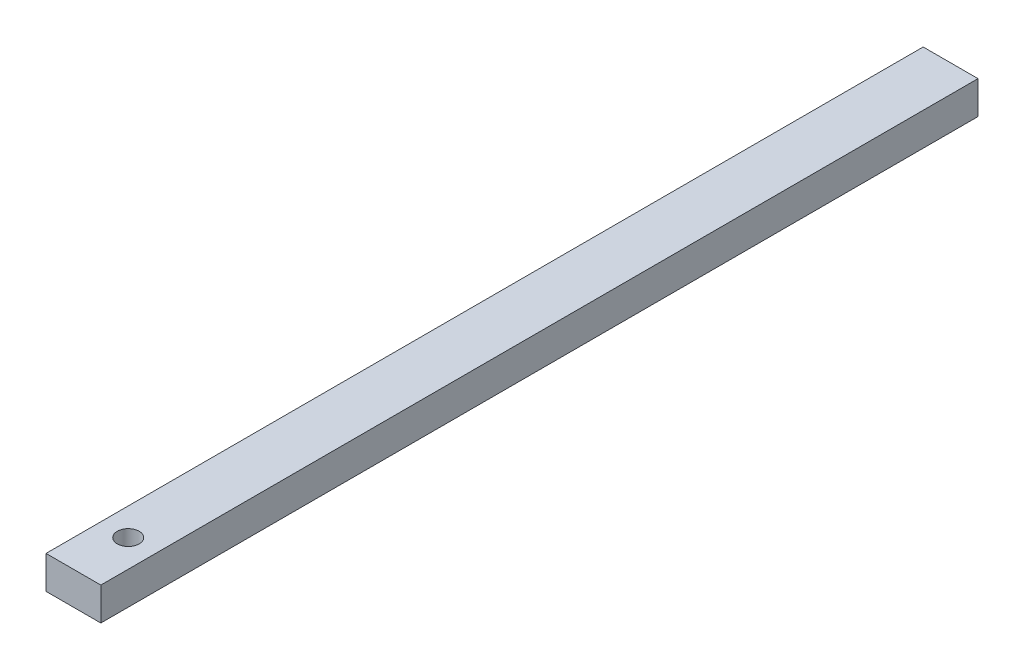
ISO-10303-21;
HEADER;
FILE_DESCRIPTION(('STEP AP214'),'2;1');
FILE_NAME('part.step','',(''),(''),'','','');
FILE_SCHEMA(('AUTOMOTIVE_DESIGN { 1 0 10303 214 1 1 1 1 }'));
ENDSEC;
DATA;
#1=APPLICATION_CONTEXT('core data for automotive mechanical design processes');
#2=APPLICATION_PROTOCOL_DEFINITION('international standard','automotive_design',2000,#1);
#3=PRODUCT_CONTEXT('',#1,'mechanical');
#4=PRODUCT('Part','Part','',(#3));
#5=PRODUCT_RELATED_PRODUCT_CATEGORY('part','',(#4));
#6=PRODUCT_DEFINITION_FORMATION('','',#4);
#7=PRODUCT_DEFINITION_CONTEXT('part definition',#1,'design');
#8=PRODUCT_DEFINITION('design','',#6,#7);
#9=PRODUCT_DEFINITION_SHAPE('','',#8);
#10=(LENGTH_UNIT() NAMED_UNIT(*) SI_UNIT(.MILLI.,.METRE.));
#11=(NAMED_UNIT(*) PLANE_ANGLE_UNIT() SI_UNIT($,.RADIAN.));
#12=(NAMED_UNIT(*) SI_UNIT($,.STERADIAN.) SOLID_ANGLE_UNIT());
#13=UNCERTAINTY_MEASURE_WITH_UNIT(LENGTH_MEASURE(1.E-05),#10,'distance_accuracy_value','');
#14=(GEOMETRIC_REPRESENTATION_CONTEXT(3) GLOBAL_UNCERTAINTY_ASSIGNED_CONTEXT((#13)) GLOBAL_UNIT_ASSIGNED_CONTEXT((#10,
#11,#12)) REPRESENTATION_CONTEXT('',''));
#15=CARTESIAN_POINT('',(0.,0.,0.));
#16=DIRECTION('',(0.,0.,1.));
#17=DIRECTION('',(1.,0.,0.));
#18=AXIS2_PLACEMENT_3D('',#15,#16,#17);
#19=CARTESIAN_POINT('',(-2.5,-1.5,80.));
#20=DIRECTION('',(1.,0.,0.));
#21=DIRECTION('',(0.,0.,-1.));
#22=AXIS2_PLACEMENT_3D('',#19,#20,#21);
#23=PLANE('',#22);
#24=DIRECTION('',(0.,-1.,0.));
#25=VECTOR('',#24,1.);
#26=CARTESIAN_POINT('',(-2.5,-1.5,0.));
#27=LINE('',#26,#25);
#28=CARTESIAN_POINT('',(-2.5,1.5,0.));
#29=VERTEX_POINT('',#28);
#30=CARTESIAN_POINT('',(-2.5,-1.5,0.));
#31=VERTEX_POINT('',#30);
#32=EDGE_CURVE('E96',#29,#31,#27,.T.);
#33=ORIENTED_EDGE('',*,*,#32,.T.);
#34=DIRECTION('',(0.,0.,-1.));
#35=VECTOR('',#34,1.);
#36=CARTESIAN_POINT('',(-2.5,-1.5,80.));
#37=LINE('',#36,#35);
#38=CARTESIAN_POINT('',(-2.5,-1.5,80.));
#39=VERTEX_POINT('',#38);
#40=EDGE_CURVE('E11',#39,#31,#37,.T.);
#41=ORIENTED_EDGE('',*,*,#40,.F.);
#42=DIRECTION('',(0.,-1.,0.));
#43=VECTOR('',#42,1.);
#44=CARTESIAN_POINT('',(-2.5,-1.5,80.));
#45=LINE('',#44,#43);
#46=CARTESIAN_POINT('',(-2.5,1.5,80.));
#47=VERTEX_POINT('',#46);
#48=EDGE_CURVE('E84',#47,#39,#45,.T.);
#49=ORIENTED_EDGE('',*,*,#48,.F.);
#50=DIRECTION('',(0.,0.,-1.));
#51=VECTOR('',#50,1.);
#52=CARTESIAN_POINT('',(-2.5,1.5,80.));
#53=LINE('',#52,#51);
#54=EDGE_CURVE('E92',#47,#29,#53,.T.);
#55=ORIENTED_EDGE('',*,*,#54,.T.);
#56=EDGE_LOOP('',(#33,#41,#49,#55));
#57=FACE_BOUND('',#56,.T.);
#58=ADVANCED_FACE('F33',(#57),#23,.F.);
#59=CARTESIAN_POINT('',(2.5,-1.5,80.));
#60=DIRECTION('',(0.,1.,0.));
#61=DIRECTION('',(-1.,0.,0.));
#62=AXIS2_PLACEMENT_3D('',#59,#60,#61);
#63=PLANE('',#62);
#64=CARTESIAN_POINT('',(0.,-1.5,75.));
#65=DIRECTION('',(0.,1.,0.));
#66=DIRECTION('',(-1.,0.,0.));
#67=AXIS2_PLACEMENT_3D('',#64,#65,#66);
#68=CIRCLE('',#67,1.);
#69=CARTESIAN_POINT('',(-1.,-1.5,75.));
#70=VERTEX_POINT('',#69);
#71=EDGE_CURVE('E99',#70,#70,#68,.T.);
#72=ORIENTED_EDGE('',*,*,#71,.T.);
#73=EDGE_LOOP('',(#72));
#74=FACE_BOUND('',#73,.T.);
#75=DIRECTION('',(1.,0.,0.));
#76=VECTOR('',#75,1.);
#77=CARTESIAN_POINT('',(2.5,-1.5,0.));
#78=LINE('',#77,#76);
#79=CARTESIAN_POINT('',(2.5,-1.5,0.));
#80=VERTEX_POINT('',#79);
#81=EDGE_CURVE('E88',#31,#80,#78,.T.);
#82=ORIENTED_EDGE('',*,*,#81,.T.);
#83=DIRECTION('',(0.,0.,-1.));
#84=VECTOR('',#83,1.);
#85=CARTESIAN_POINT('',(2.5,-1.5,80.));
#86=LINE('',#85,#84);
#87=CARTESIAN_POINT('',(2.5,-1.5,80.));
#88=VERTEX_POINT('',#87);
#89=EDGE_CURVE('E41',#88,#80,#86,.T.);
#90=ORIENTED_EDGE('',*,*,#89,.F.);
#91=DIRECTION('',(1.,0.,0.));
#92=VECTOR('',#91,1.);
#93=CARTESIAN_POINT('',(2.5,-1.5,80.));
#94=LINE('',#93,#92);
#95=EDGE_CURVE('E79',#39,#88,#94,.T.);
#96=ORIENTED_EDGE('',*,*,#95,.F.);
#97=ORIENTED_EDGE('',*,*,#40,.T.);
#98=EDGE_LOOP('',(#82,#90,#96,#97));
#99=FACE_BOUND('',#98,.T.);
#100=ADVANCED_FACE('F87',(#74,#99),#63,.F.);
#101=CARTESIAN_POINT('',(2.5,-1.5,80.));
#102=DIRECTION('',(-1.,0.,0.));
#103=DIRECTION('',(0.,0.,1.));
#104=AXIS2_PLACEMENT_3D('',#101,#102,#103);
#105=PLANE('',#104);
#106=DIRECTION('',(0.,1.,0.));
#107=VECTOR('',#106,1.);
#108=CARTESIAN_POINT('',(2.5,-1.5,0.));
#109=LINE('',#108,#107);
#110=CARTESIAN_POINT('',(2.5,1.5,0.));
#111=VERTEX_POINT('',#110);
#112=EDGE_CURVE('E66',#80,#111,#109,.T.);
#113=ORIENTED_EDGE('',*,*,#112,.T.);
#114=DIRECTION('',(0.,0.,-1.));
#115=VECTOR('',#114,1.);
#116=CARTESIAN_POINT('',(2.5,1.5,80.));
#117=LINE('',#116,#115);
#118=CARTESIAN_POINT('',(2.5,1.5,80.));
#119=VERTEX_POINT('',#118);
#120=EDGE_CURVE('E89',#119,#111,#117,.T.);
#121=ORIENTED_EDGE('',*,*,#120,.F.);
#122=DIRECTION('',(0.,1.,0.));
#123=VECTOR('',#122,1.);
#124=CARTESIAN_POINT('',(2.5,-1.5,80.));
#125=LINE('',#124,#123);
#126=EDGE_CURVE('E82',#88,#119,#125,.T.);
#127=ORIENTED_EDGE('',*,*,#126,.F.);
#128=ORIENTED_EDGE('',*,*,#89,.T.);
#129=EDGE_LOOP('',(#113,#121,#127,#128));
#130=FACE_BOUND('',#129,.T.);
#131=ADVANCED_FACE('F90',(#130),#105,.F.);
#132=CARTESIAN_POINT('',(2.5,1.5,80.));
#133=DIRECTION('',(0.,-1.,0.));
#134=DIRECTION('',(1.,0.,0.));
#135=AXIS2_PLACEMENT_3D('',#132,#133,#134);
#136=PLANE('',#135);
#137=CARTESIAN_POINT('',(0.,1.5,75.));
#138=DIRECTION('',(0.,1.,0.));
#139=DIRECTION('',(-1.,0.,0.));
#140=AXIS2_PLACEMENT_3D('',#137,#138,#139);
#141=CIRCLE('',#140,1.);
#142=CARTESIAN_POINT('',(-1.,1.5,75.));
#143=VERTEX_POINT('',#142);
#144=EDGE_CURVE('E110',#143,#143,#141,.T.);
#145=ORIENTED_EDGE('',*,*,#144,.F.);
#146=EDGE_LOOP('',(#145));
#147=FACE_BOUND('',#146,.T.);
#148=DIRECTION('',(-1.,0.,0.));
#149=VECTOR('',#148,1.);
#150=CARTESIAN_POINT('',(2.5,1.5,0.));
#151=LINE('',#150,#149);
#152=EDGE_CURVE('E72',#111,#29,#151,.T.);
#153=ORIENTED_EDGE('',*,*,#152,.T.);
#154=ORIENTED_EDGE('',*,*,#54,.F.);
#155=DIRECTION('',(-1.,0.,0.));
#156=VECTOR('',#155,1.);
#157=CARTESIAN_POINT('',(2.5,1.5,80.));
#158=LINE('',#157,#156);
#159=EDGE_CURVE('E49',#119,#47,#158,.T.);
#160=ORIENTED_EDGE('',*,*,#159,.F.);
#161=ORIENTED_EDGE('',*,*,#120,.T.);
#162=EDGE_LOOP('',(#153,#154,#160,#161));
#163=FACE_BOUND('',#162,.T.);
#164=ADVANCED_FACE('F104',(#147,#163),#136,.F.);
#165=CARTESIAN_POINT('',(0.,0.,80.));
#166=DIRECTION('',(0.,0.,1.));
#167=DIRECTION('',(1.,0.,0.));
#168=AXIS2_PLACEMENT_3D('',#165,#166,#167);
#169=PLANE('',#168);
#170=ORIENTED_EDGE('',*,*,#48,.T.);
#171=ORIENTED_EDGE('',*,*,#95,.T.);
#172=ORIENTED_EDGE('',*,*,#126,.T.);
#173=ORIENTED_EDGE('',*,*,#159,.T.);
#174=EDGE_LOOP('',(#170,#171,#172,#173));
#175=FACE_BOUND('',#174,.T.);
#176=ADVANCED_FACE('F80',(#175),#169,.T.);
#177=CARTESIAN_POINT('',(0.,0.,0.));
#178=DIRECTION('',(0.,0.,1.));
#179=DIRECTION('',(1.,0.,0.));
#180=AXIS2_PLACEMENT_3D('',#177,#178,#179);
#181=PLANE('',#180);
#182=ORIENTED_EDGE('',*,*,#32,.F.);
#183=ORIENTED_EDGE('',*,*,#152,.F.);
#184=ORIENTED_EDGE('',*,*,#112,.F.);
#185=ORIENTED_EDGE('',*,*,#81,.F.);
#186=EDGE_LOOP('',(#182,#183,#184,#185));
#187=FACE_BOUND('',#186,.T.);
#188=ADVANCED_FACE('F107',(#187),#181,.F.);
#189=CARTESIAN_POINT('',(0.,-1.5,75.));
#190=DIRECTION('',(0.,1.,0.));
#191=DIRECTION('',(-1.,0.,0.));
#192=AXIS2_PLACEMENT_3D('',#189,#190,#191);
#193=CYLINDRICAL_SURFACE('',#192,1.);
#194=ORIENTED_EDGE('',*,*,#71,.F.);
#195=EDGE_LOOP('',(#194));
#196=FACE_BOUND('',#195,.T.);
#197=ORIENTED_EDGE('',*,*,#144,.T.);
#198=EDGE_LOOP('',(#197));
#199=FACE_BOUND('',#198,.T.);
#200=ADVANCED_FACE('F117',(#196,#199),#193,.F.);
#201=CLOSED_SHELL('',(#58,#100,#131,#164,#176,#188,#200));
#202=MANIFOLD_SOLID_BREP('B2',#201);
#203=ADVANCED_BREP_SHAPE_REPRESENTATION('',(#18,#202),#14);
#204=SHAPE_DEFINITION_REPRESENTATION(#9,#203);
ENDSEC;
END-ISO-10303-21;
